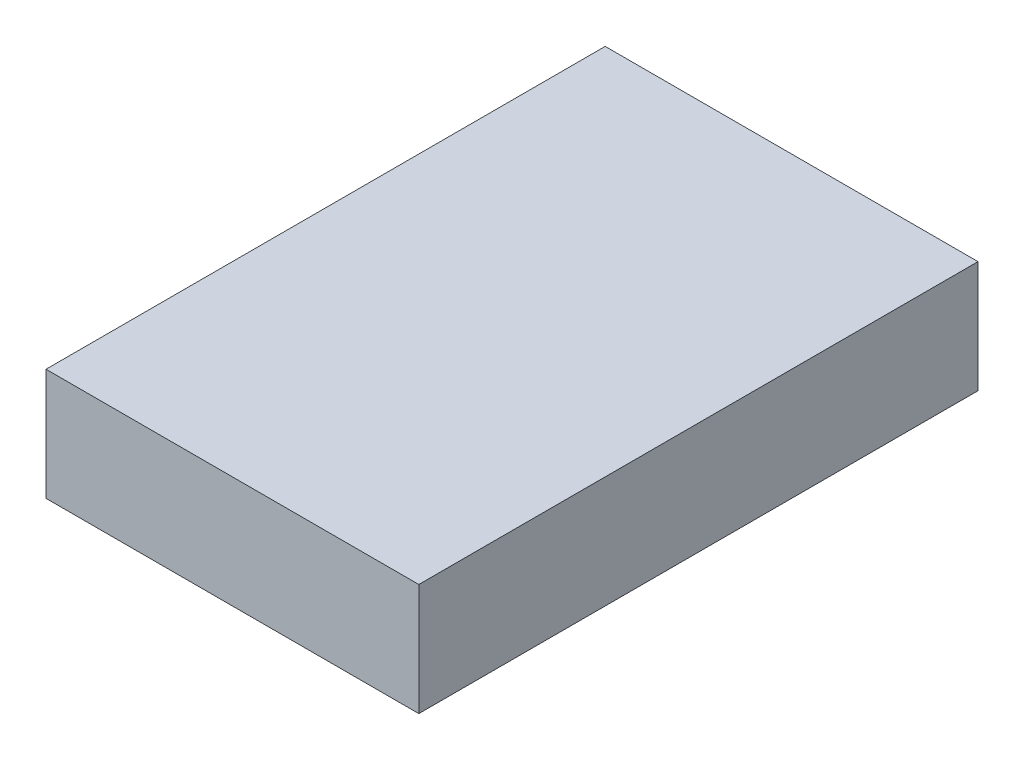
ISO-10303-21;
HEADER;
FILE_DESCRIPTION(('STEP AP214'),'2;1');
FILE_NAME('part.step','',(''),(''),'','','');
FILE_SCHEMA(('AUTOMOTIVE_DESIGN { 1 0 10303 214 1 1 1 1 }'));
ENDSEC;
DATA;
#1=APPLICATION_CONTEXT('core data for automotive mechanical design processes');
#2=APPLICATION_PROTOCOL_DEFINITION('international standard','automotive_design',2000,#1);
#3=PRODUCT_CONTEXT('',#1,'mechanical');
#4=PRODUCT('Part','Part','',(#3));
#5=PRODUCT_RELATED_PRODUCT_CATEGORY('part','',(#4));
#6=PRODUCT_DEFINITION_FORMATION('','',#4);
#7=PRODUCT_DEFINITION_CONTEXT('part definition',#1,'design');
#8=PRODUCT_DEFINITION('design','',#6,#7);
#9=PRODUCT_DEFINITION_SHAPE('','',#8);
#10=(LENGTH_UNIT() NAMED_UNIT(*) SI_UNIT(.MILLI.,.METRE.));
#11=(NAMED_UNIT(*) PLANE_ANGLE_UNIT() SI_UNIT($,.RADIAN.));
#12=(NAMED_UNIT(*) SI_UNIT($,.STERADIAN.) SOLID_ANGLE_UNIT());
#13=UNCERTAINTY_MEASURE_WITH_UNIT(LENGTH_MEASURE(1.E-05),#10,'distance_accuracy_value','');
#14=(GEOMETRIC_REPRESENTATION_CONTEXT(3) GLOBAL_UNCERTAINTY_ASSIGNED_CONTEXT((#13)) GLOBAL_UNIT_ASSIGNED_CONTEXT((#10,
#11,#12)) REPRESENTATION_CONTEXT('',''));
#15=CARTESIAN_POINT('',(0.,0.,0.));
#16=DIRECTION('',(0.,0.,1.));
#17=DIRECTION('',(1.,0.,0.));
#18=AXIS2_PLACEMENT_3D('',#15,#16,#17);
#19=CARTESIAN_POINT('',(254.,152.4,381.));
#20=DIRECTION('',(-1.,0.,0.));
#21=DIRECTION('',(0.,0.,1.));
#22=AXIS2_PLACEMENT_3D('',#19,#20,#21);
#23=PLANE('',#22);
#24=DIRECTION('',(0.,0.,-1.));
#25=VECTOR('',#24,1.);
#26=CARTESIAN_POINT('',(254.,0.,381.));
#27=LINE('',#26,#25);
#28=CARTESIAN_POINT('',(254.,0.,381.));
#29=VERTEX_POINT('',#28);
#30=CARTESIAN_POINT('',(254.,0.,-381.));
#31=VERTEX_POINT('',#30);
#32=EDGE_CURVE('E96',#29,#31,#27,.T.);
#33=ORIENTED_EDGE('',*,*,#32,.T.);
#34=DIRECTION('',(0.,-1.,0.));
#35=VECTOR('',#34,1.);
#36=CARTESIAN_POINT('',(254.,152.4,-381.));
#37=LINE('',#36,#35);
#38=CARTESIAN_POINT('',(254.,152.4,-381.));
#39=VERTEX_POINT('',#38);
#40=EDGE_CURVE('E11',#39,#31,#37,.T.);
#41=ORIENTED_EDGE('',*,*,#40,.F.);
#42=DIRECTION('',(0.,0.,-1.));
#43=VECTOR('',#42,1.);
#44=CARTESIAN_POINT('',(254.,152.4,381.));
#45=LINE('',#44,#43);
#46=CARTESIAN_POINT('',(254.,152.4,381.));
#47=VERTEX_POINT('',#46);
#48=EDGE_CURVE('E84',#47,#39,#45,.T.);
#49=ORIENTED_EDGE('',*,*,#48,.F.);
#50=DIRECTION('',(0.,-1.,0.));
#51=VECTOR('',#50,1.);
#52=CARTESIAN_POINT('',(254.,152.4,381.));
#53=LINE('',#52,#51);
#54=EDGE_CURVE('E92',#47,#29,#53,.T.);
#55=ORIENTED_EDGE('',*,*,#54,.T.);
#56=EDGE_LOOP('',(#33,#41,#49,#55));
#57=FACE_BOUND('',#56,.T.);
#58=ADVANCED_FACE('F33',(#57),#23,.F.);
#59=CARTESIAN_POINT('',(-254.,152.4,-381.));
#60=DIRECTION('',(0.,0.,1.));
#61=DIRECTION('',(1.,0.,0.));
#62=AXIS2_PLACEMENT_3D('',#59,#60,#61);
#63=PLANE('',#62);
#64=DIRECTION('',(-1.,0.,0.));
#65=VECTOR('',#64,1.);
#66=CARTESIAN_POINT('',(-254.,0.,-381.));
#67=LINE('',#66,#65);
#68=CARTESIAN_POINT('',(-254.,0.,-381.));
#69=VERTEX_POINT('',#68);
#70=EDGE_CURVE('E88',#31,#69,#67,.T.);
#71=ORIENTED_EDGE('',*,*,#70,.T.);
#72=DIRECTION('',(0.,-1.,0.));
#73=VECTOR('',#72,1.);
#74=CARTESIAN_POINT('',(-254.,152.4,-381.));
#75=LINE('',#74,#73);
#76=CARTESIAN_POINT('',(-254.,152.4,-381.));
#77=VERTEX_POINT('',#76);
#78=EDGE_CURVE('E41',#77,#69,#75,.T.);
#79=ORIENTED_EDGE('',*,*,#78,.F.);
#80=DIRECTION('',(-1.,0.,0.));
#81=VECTOR('',#80,1.);
#82=CARTESIAN_POINT('',(-254.,152.4,-381.));
#83=LINE('',#82,#81);
#84=EDGE_CURVE('E79',#39,#77,#83,.T.);
#85=ORIENTED_EDGE('',*,*,#84,.F.);
#86=ORIENTED_EDGE('',*,*,#40,.T.);
#87=EDGE_LOOP('',(#71,#79,#85,#86));
#88=FACE_BOUND('',#87,.T.);
#89=ADVANCED_FACE('F87',(#88),#63,.F.);
#90=CARTESIAN_POINT('',(-254.,152.4,381.));
#91=DIRECTION('',(1.,0.,0.));
#92=DIRECTION('',(0.,0.,-1.));
#93=AXIS2_PLACEMENT_3D('',#90,#91,#92);
#94=PLANE('',#93);
#95=DIRECTION('',(0.,0.,1.));
#96=VECTOR('',#95,1.);
#97=CARTESIAN_POINT('',(-254.,0.,381.));
#98=LINE('',#97,#96);
#99=CARTESIAN_POINT('',(-254.,0.,381.));
#100=VERTEX_POINT('',#99);
#101=EDGE_CURVE('E66',#69,#100,#98,.T.);
#102=ORIENTED_EDGE('',*,*,#101,.T.);
#103=DIRECTION('',(0.,-1.,0.));
#104=VECTOR('',#103,1.);
#105=CARTESIAN_POINT('',(-254.,152.4,381.));
#106=LINE('',#105,#104);
#107=CARTESIAN_POINT('',(-254.,152.4,381.));
#108=VERTEX_POINT('',#107);
#109=EDGE_CURVE('E89',#108,#100,#106,.T.);
#110=ORIENTED_EDGE('',*,*,#109,.F.);
#111=DIRECTION('',(0.,0.,1.));
#112=VECTOR('',#111,1.);
#113=CARTESIAN_POINT('',(-254.,152.4,381.));
#114=LINE('',#113,#112);
#115=EDGE_CURVE('E82',#77,#108,#114,.T.);
#116=ORIENTED_EDGE('',*,*,#115,.F.);
#117=ORIENTED_EDGE('',*,*,#78,.T.);
#118=EDGE_LOOP('',(#102,#110,#116,#117));
#119=FACE_BOUND('',#118,.T.);
#120=ADVANCED_FACE('F90',(#119),#94,.F.);
#121=CARTESIAN_POINT('',(-254.,152.4,381.));
#122=DIRECTION('',(0.,0.,-1.));
#123=DIRECTION('',(-1.,0.,0.));
#124=AXIS2_PLACEMENT_3D('',#121,#122,#123);
#125=PLANE('',#124);
#126=DIRECTION('',(1.,0.,0.));
#127=VECTOR('',#126,1.);
#128=CARTESIAN_POINT('',(-254.,0.,381.));
#129=LINE('',#128,#127);
#130=EDGE_CURVE('E72',#100,#29,#129,.T.);
#131=ORIENTED_EDGE('',*,*,#130,.T.);
#132=ORIENTED_EDGE('',*,*,#54,.F.);
#133=DIRECTION('',(1.,0.,0.));
#134=VECTOR('',#133,1.);
#135=CARTESIAN_POINT('',(-254.,152.4,381.));
#136=LINE('',#135,#134);
#137=EDGE_CURVE('E49',#108,#47,#136,.T.);
#138=ORIENTED_EDGE('',*,*,#137,.F.);
#139=ORIENTED_EDGE('',*,*,#109,.T.);
#140=EDGE_LOOP('',(#131,#132,#138,#139));
#141=FACE_BOUND('',#140,.T.);
#142=ADVANCED_FACE('F103',(#141),#125,.F.);
#143=CARTESIAN_POINT('',(0.,152.4,0.));
#144=DIRECTION('',(0.,-1.,0.));
#145=DIRECTION('',(0.,0.,-1.));
#146=AXIS2_PLACEMENT_3D('',#143,#144,#145);
#147=PLANE('',#146);
#148=ORIENTED_EDGE('',*,*,#48,.T.);
#149=ORIENTED_EDGE('',*,*,#84,.T.);
#150=ORIENTED_EDGE('',*,*,#115,.T.);
#151=ORIENTED_EDGE('',*,*,#137,.T.);
#152=EDGE_LOOP('',(#148,#149,#150,#151));
#153=FACE_BOUND('',#152,.T.);
#154=ADVANCED_FACE('F80',(#153),#147,.F.);
#155=CARTESIAN_POINT('',(0.,0.,0.));
#156=DIRECTION('',(0.,-1.,0.));
#157=DIRECTION('',(0.,0.,-1.));
#158=AXIS2_PLACEMENT_3D('',#155,#156,#157);
#159=PLANE('',#158);
#160=ORIENTED_EDGE('',*,*,#32,.F.);
#161=ORIENTED_EDGE('',*,*,#130,.F.);
#162=ORIENTED_EDGE('',*,*,#101,.F.);
#163=ORIENTED_EDGE('',*,*,#70,.F.);
#164=EDGE_LOOP('',(#160,#161,#162,#163));
#165=FACE_BOUND('',#164,.T.);
#166=ADVANCED_FACE('F106',(#165),#159,.T.);
#167=CLOSED_SHELL('',(#58,#89,#120,#142,#154,#166));
#168=MANIFOLD_SOLID_BREP('B2',#167);
#169=ADVANCED_BREP_SHAPE_REPRESENTATION('',(#18,#168),#14);
#170=SHAPE_DEFINITION_REPRESENTATION(#9,#169);
ENDSEC;
END-ISO-10303-21;
